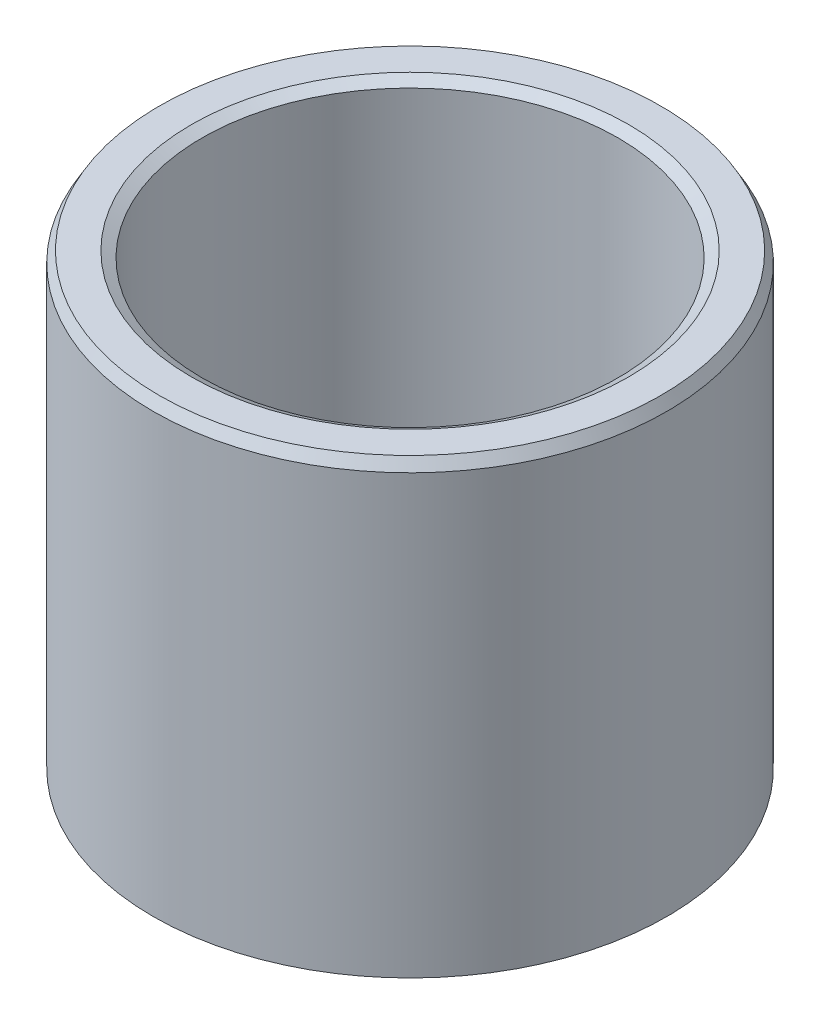
ISO-10303-21;
HEADER;
FILE_DESCRIPTION(('STEP AP214'),'2;1');
FILE_NAME('part.step','',(''),(''),'','','');
FILE_SCHEMA(('AUTOMOTIVE_DESIGN { 1 0 10303 214 1 1 1 1 }'));
ENDSEC;
DATA;
#1=APPLICATION_CONTEXT('core data for automotive mechanical design processes');
#2=APPLICATION_PROTOCOL_DEFINITION('international standard','automotive_design',2000,#1);
#3=PRODUCT_CONTEXT('',#1,'mechanical');
#4=PRODUCT('Part','Part','',(#3));
#5=PRODUCT_RELATED_PRODUCT_CATEGORY('part','',(#4));
#6=PRODUCT_DEFINITION_FORMATION('','',#4);
#7=PRODUCT_DEFINITION_CONTEXT('part definition',#1,'design');
#8=PRODUCT_DEFINITION('design','',#6,#7);
#9=PRODUCT_DEFINITION_SHAPE('','',#8);
#10=(LENGTH_UNIT() NAMED_UNIT(*) SI_UNIT(.MILLI.,.METRE.));
#11=(NAMED_UNIT(*) PLANE_ANGLE_UNIT() SI_UNIT($,.RADIAN.));
#12=(NAMED_UNIT(*) SI_UNIT($,.STERADIAN.) SOLID_ANGLE_UNIT());
#13=UNCERTAINTY_MEASURE_WITH_UNIT(LENGTH_MEASURE(1.E-05),#10,'distance_accuracy_value','');
#14=(GEOMETRIC_REPRESENTATION_CONTEXT(3) GLOBAL_UNCERTAINTY_ASSIGNED_CONTEXT((#13)) GLOBAL_UNIT_ASSIGNED_CONTEXT((#10,
#11,#12)) REPRESENTATION_CONTEXT('',''));
#15=CARTESIAN_POINT('',(0.,0.,0.));
#16=DIRECTION('',(0.,0.,1.));
#17=DIRECTION('',(1.,0.,0.));
#18=AXIS2_PLACEMENT_3D('',#15,#16,#17);
#19=CARTESIAN_POINT('',(0.,75.1542868511249,0.));
#20=DIRECTION('',(0.,-1.,0.));
#21=DIRECTION('',(0.,0.,-1.));
#22=AXIS2_PLACEMENT_3D('',#19,#20,#21);
#23=CYLINDRICAL_SURFACE('',#22,42.5);
#24=CARTESIAN_POINT('',(0.,1.01895058689602,0.));
#25=DIRECTION('',(0.,1.,0.));
#26=DIRECTION('',(0.,0.,1.));
#27=AXIS2_PLACEMENT_3D('',#24,#25,#26);
#28=CIRCLE('',#27,42.5);
#29=CARTESIAN_POINT('',(0.,1.01895058689602,42.5));
#30=VERTEX_POINT('',#29);
#31=EDGE_CURVE('E10',#30,#30,#28,.T.);
#32=ORIENTED_EDGE('',*,*,#31,.T.);
#33=EDGE_LOOP('',(#32));
#34=FACE_BOUND('',#33,.T.);
#35=CARTESIAN_POINT('',(0.,73.3894126642188,0.));
#36=DIRECTION('',(0.,1.,0.));
#37=DIRECTION('',(0.,0.,1.));
#38=AXIS2_PLACEMENT_3D('',#35,#36,#37);
#39=CIRCLE('',#38,42.5);
#40=CARTESIAN_POINT('',(0.,73.3894126642188,42.5));
#41=VERTEX_POINT('',#40);
#42=EDGE_CURVE('E50',#41,#41,#39,.F.);
#43=ORIENTED_EDGE('',*,*,#42,.T.);
#44=EDGE_LOOP('',(#43));
#45=FACE_BOUND('',#44,.T.);
#46=ADVANCED_FACE('F39',(#34,#45),#23,.T.);
#47=CARTESIAN_POINT('',(0.,75.1542868511249,0.));
#48=DIRECTION('',(0.,1.,0.));
#49=DIRECTION('',(0.,0.,1.));
#50=AXIS2_PLACEMENT_3D('',#47,#48,#49);
#51=PLANE('',#50);
#52=CARTESIAN_POINT('',(0.,75.1542868511249,0.));
#53=DIRECTION('',(0.,1.,0.));
#54=DIRECTION('',(0.,0.,1.));
#55=AXIS2_PLACEMENT_3D('',#52,#53,#54);
#56=CIRCLE('',#55,36.1650063663714);
#57=CARTESIAN_POINT('',(0.,75.1542868511249,36.1650063663714));
#58=VERTEX_POINT('',#57);
#59=EDGE_CURVE('E58',#58,#58,#56,.F.);
#60=ORIENTED_EDGE('',*,*,#59,.T.);
#61=EDGE_LOOP('',(#60));
#62=FACE_BOUND('',#61,.T.);
#63=CARTESIAN_POINT('',(0.,75.1542868511249,0.));
#64=DIRECTION('',(0.,1.,0.));
#65=DIRECTION('',(0.,0.,1.));
#66=AXIS2_PLACEMENT_3D('',#63,#64,#65);
#67=CIRCLE('',#66,41.481049413104);
#68=CARTESIAN_POINT('',(0.,75.1542868511249,41.481049413104));
#69=VERTEX_POINT('',#68);
#70=EDGE_CURVE('E61',#69,#69,#67,.T.);
#71=ORIENTED_EDGE('',*,*,#70,.T.);
#72=EDGE_LOOP('',(#71));
#73=FACE_BOUND('',#72,.T.);
#74=ADVANCED_FACE('F88',(#62,#73),#51,.T.);
#75=CARTESIAN_POINT('',(0.,0.,0.));
#76=DIRECTION('',(0.,1.,0.));
#77=DIRECTION('',(0.,0.,1.));
#78=AXIS2_PLACEMENT_3D('',#75,#76,#77);
#79=PLANE('',#78);
#80=CARTESIAN_POINT('',(0.,0.,0.));
#81=DIRECTION('',(0.,1.,0.));
#82=DIRECTION('',(0.,0.,1.));
#83=AXIS2_PLACEMENT_3D('',#80,#81,#82);
#84=CIRCLE('',#83,35.4190827663614);
#85=CARTESIAN_POINT('',(0.,0.,35.4190827663614));
#86=VERTEX_POINT('',#85);
#87=EDGE_CURVE('E51',#86,#86,#84,.T.);
#88=ORIENTED_EDGE('',*,*,#87,.T.);
#89=EDGE_LOOP('',(#88));
#90=FACE_BOUND('',#89,.T.);
#91=CARTESIAN_POINT('',(0.,0.,0.));
#92=DIRECTION('',(0.,1.,0.));
#93=DIRECTION('',(0.,0.,1.));
#94=AXIS2_PLACEMENT_3D('',#91,#92,#93);
#95=CIRCLE('',#94,40.7351258130939);
#96=CARTESIAN_POINT('',(0.,0.,40.7351258130939));
#97=VERTEX_POINT('',#96);
#98=EDGE_CURVE('E54',#97,#97,#95,.F.);
#99=ORIENTED_EDGE('',*,*,#98,.T.);
#100=EDGE_LOOP('',(#99));
#101=FACE_BOUND('',#100,.T.);
#102=ADVANCED_FACE('F83',(#90,#101),#79,.F.);
#103=CARTESIAN_POINT('',(0.,75.1542868511249,0.));
#104=DIRECTION('',(0.,-1.,0.));
#105=DIRECTION('',(0.,0.,-1.));
#106=AXIS2_PLACEMENT_3D('',#103,#104,#105);
#107=CYLINDRICAL_SURFACE('',#106,34.4001321794653);
#108=CARTESIAN_POINT('',(0.,74.1353362642289,0.));
#109=DIRECTION('',(0.,1.,0.));
#110=DIRECTION('',(0.,0.,1.));
#111=AXIS2_PLACEMENT_3D('',#108,#109,#110);
#112=CIRCLE('',#111,34.4001321794653);
#113=CARTESIAN_POINT('',(0.,74.1353362642289,34.4001321794653));
#114=VERTEX_POINT('',#113);
#115=EDGE_CURVE('E67',#114,#114,#112,.T.);
#116=ORIENTED_EDGE('',*,*,#115,.T.);
#117=EDGE_LOOP('',(#116));
#118=FACE_BOUND('',#117,.T.);
#119=CARTESIAN_POINT('',(0.,1.76487418690607,0.));
#120=DIRECTION('',(0.,1.,0.));
#121=DIRECTION('',(0.,0.,1.));
#122=AXIS2_PLACEMENT_3D('',#119,#120,#121);
#123=CIRCLE('',#122,34.4001321794653);
#124=CARTESIAN_POINT('',(0.,1.76487418690607,34.4001321794653));
#125=VERTEX_POINT('',#124);
#126=EDGE_CURVE('E69',#125,#125,#123,.F.);
#127=ORIENTED_EDGE('',*,*,#126,.T.);
#128=EDGE_LOOP('',(#127));
#129=FACE_BOUND('',#128,.T.);
#130=ADVANCED_FACE('F71',(#118,#129),#107,.F.);
#131=CARTESIAN_POINT('',(0.,74.1353362642289,0.));
#132=DIRECTION('',(0.,1.,0.));
#133=DIRECTION('',(0.,0.,1.));
#134=AXIS2_PLACEMENT_3D('',#131,#132,#133);
#135=CONICAL_SURFACE('',#134,34.4001321794653,1.0471975511966);
#136=ORIENTED_EDGE('',*,*,#59,.F.);
#137=EDGE_LOOP('',(#136));
#138=FACE_BOUND('',#137,.T.);
#139=ORIENTED_EDGE('',*,*,#115,.F.);
#140=EDGE_LOOP('',(#139));
#141=FACE_BOUND('',#140,.T.);
#142=ADVANCED_FACE('F77',(#138,#141),#135,.F.);
#143=CARTESIAN_POINT('',(0.,0.,0.));
#144=DIRECTION('',(0.,-1.,0.));
#145=DIRECTION('',(0.,0.,-1.));
#146=AXIS2_PLACEMENT_3D('',#143,#144,#145);
#147=CONICAL_SURFACE('',#146,35.4190827663614,0.523598775598293);
#148=ORIENTED_EDGE('',*,*,#126,.F.);
#149=EDGE_LOOP('',(#148));
#150=FACE_BOUND('',#149,.T.);
#151=ORIENTED_EDGE('',*,*,#87,.F.);
#152=EDGE_LOOP('',(#151));
#153=FACE_BOUND('',#152,.T.);
#154=ADVANCED_FACE('F73',(#150,#153),#147,.F.);
#155=CARTESIAN_POINT('',(0.,1.01895058689602,0.));
#156=DIRECTION('',(0.,1.,0.));
#157=DIRECTION('',(0.,0.,1.));
#158=AXIS2_PLACEMENT_3D('',#155,#156,#157);
#159=CONICAL_SURFACE('',#158,42.5,1.04719755119661);
#160=ORIENTED_EDGE('',*,*,#98,.F.);
#161=EDGE_LOOP('',(#160));
#162=FACE_BOUND('',#161,.T.);
#163=ORIENTED_EDGE('',*,*,#31,.F.);
#164=EDGE_LOOP('',(#163));
#165=FACE_BOUND('',#164,.T.);
#166=ADVANCED_FACE('F76',(#162,#165),#159,.T.);
#167=CARTESIAN_POINT('',(0.,75.1542868511249,0.));
#168=DIRECTION('',(0.,-1.,0.));
#169=DIRECTION('',(0.,0.,-1.));
#170=AXIS2_PLACEMENT_3D('',#167,#168,#169);
#171=CONICAL_SURFACE('',#170,41.481049413104,0.523598775598291);
#172=ORIENTED_EDGE('',*,*,#42,.F.);
#173=EDGE_LOOP('',(#172));
#174=FACE_BOUND('',#173,.T.);
#175=ORIENTED_EDGE('',*,*,#70,.F.);
#176=EDGE_LOOP('',(#175));
#177=FACE_BOUND('',#176,.T.);
#178=ADVANCED_FACE('F45',(#174,#177),#171,.T.);
#179=CLOSED_SHELL('',(#46,#74,#102,#130,#142,#154,#166,#178));
#180=MANIFOLD_SOLID_BREP('B2',#179);
#181=ADVANCED_BREP_SHAPE_REPRESENTATION('',(#18,#180),#14);
#182=SHAPE_DEFINITION_REPRESENTATION(#9,#181);
ENDSEC;
END-ISO-10303-21;
